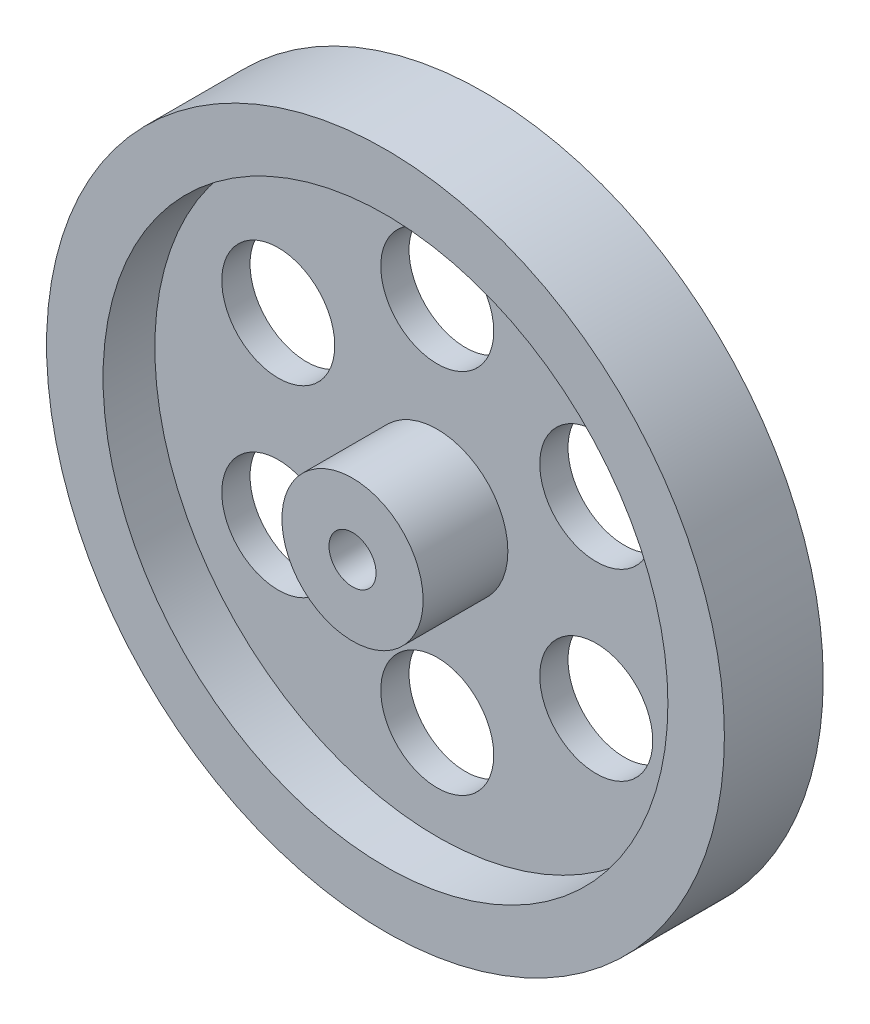
ISO-10303-21;
HEADER;
FILE_DESCRIPTION(('STEP AP214'),'2;1');
FILE_NAME('part.step','',(''),(''),'','','');
FILE_SCHEMA(('AUTOMOTIVE_DESIGN { 1 0 10303 214 1 1 1 1 }'));
ENDSEC;
DATA;
#1=APPLICATION_CONTEXT('core data for automotive mechanical design processes');
#2=APPLICATION_PROTOCOL_DEFINITION('international standard','automotive_design',2000,#1);
#3=PRODUCT_CONTEXT('',#1,'mechanical');
#4=PRODUCT('Part','Part','',(#3));
#5=PRODUCT_RELATED_PRODUCT_CATEGORY('part','',(#4));
#6=PRODUCT_DEFINITION_FORMATION('','',#4);
#7=PRODUCT_DEFINITION_CONTEXT('part definition',#1,'design');
#8=PRODUCT_DEFINITION('design','',#6,#7);
#9=PRODUCT_DEFINITION_SHAPE('','',#8);
#10=(LENGTH_UNIT() NAMED_UNIT(*) SI_UNIT(.MILLI.,.METRE.));
#11=(NAMED_UNIT(*) PLANE_ANGLE_UNIT() SI_UNIT($,.RADIAN.));
#12=(NAMED_UNIT(*) SI_UNIT($,.STERADIAN.) SOLID_ANGLE_UNIT());
#13=UNCERTAINTY_MEASURE_WITH_UNIT(LENGTH_MEASURE(1.E-05),#10,'distance_accuracy_value','');
#14=(GEOMETRIC_REPRESENTATION_CONTEXT(3) GLOBAL_UNCERTAINTY_ASSIGNED_CONTEXT((#13)) GLOBAL_UNIT_ASSIGNED_CONTEXT((#10,
#11,#12)) REPRESENTATION_CONTEXT('',''));
#15=CARTESIAN_POINT('',(0.,0.,0.));
#16=DIRECTION('',(0.,0.,1.));
#17=DIRECTION('',(1.,0.,0.));
#18=AXIS2_PLACEMENT_3D('',#15,#16,#17);
#19=CARTESIAN_POINT('',(0.,0.,12.));
#20=DIRECTION('',(0.,0.,-1.));
#21=DIRECTION('',(-1.,0.,0.));
#22=AXIS2_PLACEMENT_3D('',#19,#20,#21);
#23=CYLINDRICAL_SURFACE('',#22,7.5);
#24=CARTESIAN_POINT('',(0.,0.,3.));
#25=DIRECTION('',(0.,0.,1.));
#26=DIRECTION('',(1.,0.,0.));
#27=AXIS2_PLACEMENT_3D('',#24,#25,#26);
#28=CIRCLE('',#27,7.5);
#29=CARTESIAN_POINT('',(7.5,0.,3.));
#30=VERTEX_POINT('',#29);
#31=EDGE_CURVE('E75',#30,#30,#28,.T.);
#32=ORIENTED_EDGE('',*,*,#31,.T.);
#33=EDGE_LOOP('',(#32));
#34=FACE_BOUND('',#33,.T.);
#35=CARTESIAN_POINT('',(0.,0.,12.));
#36=DIRECTION('',(0.,0.,1.));
#37=DIRECTION('',(1.,0.,0.));
#38=AXIS2_PLACEMENT_3D('',#35,#36,#37);
#39=CIRCLE('',#38,7.5);
#40=CARTESIAN_POINT('',(7.5,0.,12.));
#41=VERTEX_POINT('',#40);
#42=EDGE_CURVE('E46',#41,#41,#39,.T.);
#43=ORIENTED_EDGE('',*,*,#42,.F.);
#44=EDGE_LOOP('',(#43));
#45=FACE_BOUND('',#44,.T.);
#46=ADVANCED_FACE('F39',(#34,#45),#23,.T.);
#47=CARTESIAN_POINT('',(0.,0.,12.));
#48=DIRECTION('',(0.,0.,-1.));
#49=DIRECTION('',(-1.,0.,0.));
#50=AXIS2_PLACEMENT_3D('',#47,#48,#49);
#51=CYLINDRICAL_SURFACE('',#50,2.5);
#52=CARTESIAN_POINT('',(0.,0.,12.));
#53=DIRECTION('',(0.,0.,1.));
#54=DIRECTION('',(1.,0.,0.));
#55=AXIS2_PLACEMENT_3D('',#52,#53,#54);
#56=CIRCLE('',#55,2.5);
#57=CARTESIAN_POINT('',(2.5,0.,12.));
#58=VERTEX_POINT('',#57);
#59=EDGE_CURVE('E10',#58,#58,#56,.T.);
#60=ORIENTED_EDGE('',*,*,#59,.T.);
#61=EDGE_LOOP('',(#60));
#62=FACE_BOUND('',#61,.T.);
#63=CARTESIAN_POINT('',(0.,0.,0.));
#64=DIRECTION('',(0.,0.,1.));
#65=DIRECTION('',(1.,0.,0.));
#66=AXIS2_PLACEMENT_3D('',#63,#64,#65);
#67=CIRCLE('',#66,2.5);
#68=CARTESIAN_POINT('',(2.5,0.,0.));
#69=VERTEX_POINT('',#68);
#70=EDGE_CURVE('E42',#69,#69,#67,.T.);
#71=ORIENTED_EDGE('',*,*,#70,.F.);
#72=EDGE_LOOP('',(#71));
#73=FACE_BOUND('',#72,.T.);
#74=ADVANCED_FACE('F130',(#62,#73),#51,.F.);
#75=CARTESIAN_POINT('',(0.,0.,12.));
#76=DIRECTION('',(0.,0.,1.));
#77=DIRECTION('',(1.,0.,0.));
#78=AXIS2_PLACEMENT_3D('',#75,#76,#77);
#79=PLANE('',#78);
#80=ORIENTED_EDGE('',*,*,#42,.T.);
#81=EDGE_LOOP('',(#80));
#82=FACE_BOUND('',#81,.T.);
#83=ORIENTED_EDGE('',*,*,#59,.F.);
#84=EDGE_LOOP('',(#83));
#85=FACE_BOUND('',#84,.T.);
#86=ADVANCED_FACE('F135',(#82,#85),#79,.T.);
#87=CARTESIAN_POINT('',(0.,0.,0.));
#88=DIRECTION('',(0.,0.,1.));
#89=DIRECTION('',(1.,0.,0.));
#90=AXIS2_PLACEMENT_3D('',#87,#88,#89);
#91=PLANE('',#90);
#92=ORIENTED_EDGE('',*,*,#70,.T.);
#93=EDGE_LOOP('',(#92));
#94=FACE_BOUND('',#93,.T.);
#95=CARTESIAN_POINT('',(0.,19.5,0.));
#96=DIRECTION('',(0.,0.,1.));
#97=DIRECTION('',(1.,0.,0.));
#98=AXIS2_PLACEMENT_3D('',#95,#96,#97);
#99=CIRCLE('',#98,6.);
#100=CARTESIAN_POINT('',(6.,19.5,0.));
#101=VERTEX_POINT('',#100);
#102=EDGE_CURVE('E71',#101,#101,#99,.T.);
#103=ORIENTED_EDGE('',*,*,#102,.T.);
#104=EDGE_LOOP('',(#103));
#105=FACE_BOUND('',#104,.T.);
#106=CARTESIAN_POINT('',(0.,0.,0.));
#107=DIRECTION('',(0.,0.,1.));
#108=DIRECTION('',(1.,0.,0.));
#109=AXIS2_PLACEMENT_3D('',#106,#107,#108);
#110=CIRCLE('',#109,30.);
#111=CARTESIAN_POINT('',(30.,0.,0.));
#112=VERTEX_POINT('',#111);
#113=EDGE_CURVE('E68',#112,#112,#110,.T.);
#114=ORIENTED_EDGE('',*,*,#113,.F.);
#115=EDGE_LOOP('',(#114));
#116=FACE_BOUND('',#115,.T.);
#117=CARTESIAN_POINT('',(-16.8874953737966,9.74999999999999,0.));
#118=DIRECTION('',(0.,0.,1.));
#119=DIRECTION('',(1.,0.,0.));
#120=AXIS2_PLACEMENT_3D('',#117,#118,#119);
#121=CIRCLE('',#120,6.);
#122=CARTESIAN_POINT('',(-10.8874953737966,9.74999999999999,0.));
#123=VERTEX_POINT('',#122);
#124=EDGE_CURVE('E65',#123,#123,#121,.T.);
#125=ORIENTED_EDGE('',*,*,#124,.T.);
#126=EDGE_LOOP('',(#125));
#127=FACE_BOUND('',#126,.T.);
#128=CARTESIAN_POINT('',(-16.8874953737966,-9.75000000000001,0.));
#129=DIRECTION('',(0.,0.,1.));
#130=DIRECTION('',(1.,0.,0.));
#131=AXIS2_PLACEMENT_3D('',#128,#129,#130);
#132=CIRCLE('',#131,6.);
#133=CARTESIAN_POINT('',(-10.8874953737966,-9.75000000000001,0.));
#134=VERTEX_POINT('',#133);
#135=EDGE_CURVE('E62',#134,#134,#132,.T.);
#136=ORIENTED_EDGE('',*,*,#135,.T.);
#137=EDGE_LOOP('',(#136));
#138=FACE_BOUND('',#137,.T.);
#139=CARTESIAN_POINT('',(0.,-19.5,0.));
#140=DIRECTION('',(0.,0.,1.));
#141=DIRECTION('',(1.,0.,0.));
#142=AXIS2_PLACEMENT_3D('',#139,#140,#141);
#143=CIRCLE('',#142,6.);
#144=CARTESIAN_POINT('',(6.,-19.5,0.));
#145=VERTEX_POINT('',#144);
#146=EDGE_CURVE('E59',#145,#145,#143,.T.);
#147=ORIENTED_EDGE('',*,*,#146,.T.);
#148=EDGE_LOOP('',(#147));
#149=FACE_BOUND('',#148,.T.);
#150=CARTESIAN_POINT('',(16.8874953737966,-9.75,0.));
#151=DIRECTION('',(0.,0.,1.));
#152=DIRECTION('',(1.,0.,0.));
#153=AXIS2_PLACEMENT_3D('',#150,#151,#152);
#154=CIRCLE('',#153,6.);
#155=CARTESIAN_POINT('',(22.8874953737966,-9.75,0.));
#156=VERTEX_POINT('',#155);
#157=EDGE_CURVE('E56',#156,#156,#154,.T.);
#158=ORIENTED_EDGE('',*,*,#157,.T.);
#159=EDGE_LOOP('',(#158));
#160=FACE_BOUND('',#159,.T.);
#161=CARTESIAN_POINT('',(16.8874953737966,9.75000000000001,0.));
#162=DIRECTION('',(0.,0.,1.));
#163=DIRECTION('',(1.,0.,0.));
#164=AXIS2_PLACEMENT_3D('',#161,#162,#163);
#165=CIRCLE('',#164,6.);
#166=CARTESIAN_POINT('',(22.8874953737966,9.75000000000001,0.));
#167=VERTEX_POINT('',#166);
#168=EDGE_CURVE('E52',#167,#167,#165,.T.);
#169=ORIENTED_EDGE('',*,*,#168,.T.);
#170=EDGE_LOOP('',(#169));
#171=FACE_BOUND('',#170,.T.);
#172=ADVANCED_FACE('F142',(#94,#105,#116,#127,#138,#149,#160,#171),#91,.F.);
#173=CARTESIAN_POINT('',(16.8874953737966,9.75000000000001,3.));
#174=DIRECTION('',(0.,0.,-1.));
#175=DIRECTION('',(-1.,0.,0.));
#176=AXIS2_PLACEMENT_3D('',#173,#174,#175);
#177=CYLINDRICAL_SURFACE('',#176,6.);
#178=CARTESIAN_POINT('',(16.8874953737966,9.75000000000001,3.));
#179=DIRECTION('',(0.,0.,1.));
#180=DIRECTION('',(1.,0.,0.));
#181=AXIS2_PLACEMENT_3D('',#178,#179,#180);
#182=CIRCLE('',#181,6.);
#183=CARTESIAN_POINT('',(22.8874953737966,9.75000000000001,3.));
#184=VERTEX_POINT('',#183);
#185=EDGE_CURVE('E78',#184,#184,#182,.T.);
#186=ORIENTED_EDGE('',*,*,#185,.T.);
#187=EDGE_LOOP('',(#186));
#188=FACE_BOUND('',#187,.T.);
#189=ORIENTED_EDGE('',*,*,#168,.F.);
#190=EDGE_LOOP('',(#189));
#191=FACE_BOUND('',#190,.T.);
#192=ADVANCED_FACE('F147',(#188,#191),#177,.F.);
#193=CARTESIAN_POINT('',(16.8874953737966,-9.75,3.));
#194=DIRECTION('',(0.,0.,-1.));
#195=DIRECTION('',(-1.,0.,0.));
#196=AXIS2_PLACEMENT_3D('',#193,#194,#195);
#197=CYLINDRICAL_SURFACE('',#196,6.);
#198=CARTESIAN_POINT('',(16.8874953737966,-9.75,3.));
#199=DIRECTION('',(0.,0.,1.));
#200=DIRECTION('',(1.,0.,0.));
#201=AXIS2_PLACEMENT_3D('',#198,#199,#200);
#202=CIRCLE('',#201,6.);
#203=CARTESIAN_POINT('',(22.8874953737966,-9.75,3.));
#204=VERTEX_POINT('',#203);
#205=EDGE_CURVE('E81',#204,#204,#202,.T.);
#206=ORIENTED_EDGE('',*,*,#205,.T.);
#207=EDGE_LOOP('',(#206));
#208=FACE_BOUND('',#207,.T.);
#209=ORIENTED_EDGE('',*,*,#157,.F.);
#210=EDGE_LOOP('',(#209));
#211=FACE_BOUND('',#210,.T.);
#212=ADVANCED_FACE('F166',(#208,#211),#197,.F.);
#213=CARTESIAN_POINT('',(0.,-19.5,3.));
#214=DIRECTION('',(0.,0.,-1.));
#215=DIRECTION('',(-1.,0.,0.));
#216=AXIS2_PLACEMENT_3D('',#213,#214,#215);
#217=CYLINDRICAL_SURFACE('',#216,6.);
#218=CARTESIAN_POINT('',(0.,-19.5,3.));
#219=DIRECTION('',(0.,0.,1.));
#220=DIRECTION('',(1.,0.,0.));
#221=AXIS2_PLACEMENT_3D('',#218,#219,#220);
#222=CIRCLE('',#221,6.);
#223=CARTESIAN_POINT('',(6.,-19.5,3.));
#224=VERTEX_POINT('',#223);
#225=EDGE_CURVE('E84',#224,#224,#222,.T.);
#226=ORIENTED_EDGE('',*,*,#225,.T.);
#227=EDGE_LOOP('',(#226));
#228=FACE_BOUND('',#227,.T.);
#229=ORIENTED_EDGE('',*,*,#146,.F.);
#230=EDGE_LOOP('',(#229));
#231=FACE_BOUND('',#230,.T.);
#232=ADVANCED_FACE('F162',(#228,#231),#217,.F.);
#233=CARTESIAN_POINT('',(-16.8874953737966,-9.75000000000001,3.));
#234=DIRECTION('',(0.,0.,-1.));
#235=DIRECTION('',(-1.,0.,0.));
#236=AXIS2_PLACEMENT_3D('',#233,#234,#235);
#237=CYLINDRICAL_SURFACE('',#236,6.);
#238=CARTESIAN_POINT('',(-16.8874953737966,-9.75000000000001,3.));
#239=DIRECTION('',(0.,0.,1.));
#240=DIRECTION('',(1.,0.,0.));
#241=AXIS2_PLACEMENT_3D('',#238,#239,#240);
#242=CIRCLE('',#241,6.);
#243=CARTESIAN_POINT('',(-10.8874953737966,-9.75000000000001,3.));
#244=VERTEX_POINT('',#243);
#245=EDGE_CURVE('E87',#244,#244,#242,.T.);
#246=ORIENTED_EDGE('',*,*,#245,.T.);
#247=EDGE_LOOP('',(#246));
#248=FACE_BOUND('',#247,.T.);
#249=ORIENTED_EDGE('',*,*,#135,.F.);
#250=EDGE_LOOP('',(#249));
#251=FACE_BOUND('',#250,.T.);
#252=ADVANCED_FACE('F158',(#248,#251),#237,.F.);
#253=CARTESIAN_POINT('',(-16.8874953737966,9.74999999999999,3.));
#254=DIRECTION('',(0.,0.,-1.));
#255=DIRECTION('',(-1.,0.,0.));
#256=AXIS2_PLACEMENT_3D('',#253,#254,#255);
#257=CYLINDRICAL_SURFACE('',#256,6.);
#258=CARTESIAN_POINT('',(-16.8874953737966,9.74999999999999,3.));
#259=DIRECTION('',(0.,0.,1.));
#260=DIRECTION('',(1.,0.,0.));
#261=AXIS2_PLACEMENT_3D('',#258,#259,#260);
#262=CIRCLE('',#261,6.);
#263=CARTESIAN_POINT('',(-10.8874953737966,9.74999999999999,3.));
#264=VERTEX_POINT('',#263);
#265=EDGE_CURVE('E90',#264,#264,#262,.T.);
#266=ORIENTED_EDGE('',*,*,#265,.T.);
#267=EDGE_LOOP('',(#266));
#268=FACE_BOUND('',#267,.T.);
#269=ORIENTED_EDGE('',*,*,#124,.F.);
#270=EDGE_LOOP('',(#269));
#271=FACE_BOUND('',#270,.T.);
#272=ADVANCED_FACE('F154',(#268,#271),#257,.F.);
#273=CARTESIAN_POINT('',(0.,19.5,3.));
#274=DIRECTION('',(0.,0.,-1.));
#275=DIRECTION('',(-1.,0.,0.));
#276=AXIS2_PLACEMENT_3D('',#273,#274,#275);
#277=CYLINDRICAL_SURFACE('',#276,6.);
#278=CARTESIAN_POINT('',(0.,19.5,3.));
#279=DIRECTION('',(0.,0.,1.));
#280=DIRECTION('',(1.,0.,0.));
#281=AXIS2_PLACEMENT_3D('',#278,#279,#280);
#282=CIRCLE('',#281,6.);
#283=CARTESIAN_POINT('',(6.,19.5,3.));
#284=VERTEX_POINT('',#283);
#285=EDGE_CURVE('E55',#284,#284,#282,.T.);
#286=ORIENTED_EDGE('',*,*,#285,.T.);
#287=EDGE_LOOP('',(#286));
#288=FACE_BOUND('',#287,.T.);
#289=ORIENTED_EDGE('',*,*,#102,.F.);
#290=EDGE_LOOP('',(#289));
#291=FACE_BOUND('',#290,.T.);
#292=ADVANCED_FACE('F151',(#288,#291),#277,.F.);
#293=CARTESIAN_POINT('',(0.,0.,3.));
#294=DIRECTION('',(0.,0.,1.));
#295=DIRECTION('',(1.,0.,0.));
#296=AXIS2_PLACEMENT_3D('',#293,#294,#295);
#297=PLANE('',#296);
#298=ORIENTED_EDGE('',*,*,#285,.F.);
#299=EDGE_LOOP('',(#298));
#300=FACE_BOUND('',#299,.T.);
#301=CARTESIAN_POINT('',(0.,0.,3.));
#302=DIRECTION('',(0.,0.,1.));
#303=DIRECTION('',(1.,0.,0.));
#304=AXIS2_PLACEMENT_3D('',#301,#302,#303);
#305=CIRCLE('',#304,30.);
#306=CARTESIAN_POINT('',(30.,0.,3.));
#307=VERTEX_POINT('',#306);
#308=EDGE_CURVE('E74',#307,#307,#305,.T.);
#309=ORIENTED_EDGE('',*,*,#308,.T.);
#310=EDGE_LOOP('',(#309));
#311=FACE_BOUND('',#310,.T.);
#312=ORIENTED_EDGE('',*,*,#265,.F.);
#313=EDGE_LOOP('',(#312));
#314=FACE_BOUND('',#313,.T.);
#315=ORIENTED_EDGE('',*,*,#245,.F.);
#316=EDGE_LOOP('',(#315));
#317=FACE_BOUND('',#316,.T.);
#318=ORIENTED_EDGE('',*,*,#225,.F.);
#319=EDGE_LOOP('',(#318));
#320=FACE_BOUND('',#319,.T.);
#321=ORIENTED_EDGE('',*,*,#205,.F.);
#322=EDGE_LOOP('',(#321));
#323=FACE_BOUND('',#322,.T.);
#324=ORIENTED_EDGE('',*,*,#185,.F.);
#325=EDGE_LOOP('',(#324));
#326=FACE_BOUND('',#325,.T.);
#327=ORIENTED_EDGE('',*,*,#31,.F.);
#328=EDGE_LOOP('',(#327));
#329=FACE_BOUND('',#328,.T.);
#330=ADVANCED_FACE('F126',(#300,#311,#314,#317,#320,#323,#326,#329),#297,.T.);
#331=CARTESIAN_POINT('',(0.,0.,-2.));
#332=DIRECTION('',(0.,0.,1.));
#333=DIRECTION('',(1.,0.,0.));
#334=AXIS2_PLACEMENT_3D('',#331,#332,#333);
#335=CYLINDRICAL_SURFACE('',#334,30.);
#336=CARTESIAN_POINT('',(0.,0.,-2.));
#337=DIRECTION('',(0.,0.,1.));
#338=DIRECTION('',(1.,0.,0.));
#339=AXIS2_PLACEMENT_3D('',#336,#337,#338);
#340=CIRCLE('',#339,30.);
#341=CARTESIAN_POINT('',(30.,0.,-2.));
#342=VERTEX_POINT('',#341);
#343=EDGE_CURVE('E97',#342,#342,#340,.T.);
#344=ORIENTED_EDGE('',*,*,#343,.F.);
#345=EDGE_LOOP('',(#344));
#346=FACE_BOUND('',#345,.T.);
#347=ORIENTED_EDGE('',*,*,#113,.T.);
#348=EDGE_LOOP('',(#347));
#349=FACE_BOUND('',#348,.T.);
#350=ADVANCED_FACE('F116',(#346,#349),#335,.F.);
#351=CARTESIAN_POINT('',(0.,0.,-2.));
#352=DIRECTION('',(0.,0.,1.));
#353=DIRECTION('',(1.,0.,0.));
#354=AXIS2_PLACEMENT_3D('',#351,#352,#353);
#355=CYLINDRICAL_SURFACE('',#354,36.);
#356=CARTESIAN_POINT('',(0.,0.,-2.));
#357=DIRECTION('',(0.,0.,1.));
#358=DIRECTION('',(1.,0.,0.));
#359=AXIS2_PLACEMENT_3D('',#356,#357,#358);
#360=CIRCLE('',#359,36.);
#361=CARTESIAN_POINT('',(36.,0.,-2.));
#362=VERTEX_POINT('',#361);
#363=EDGE_CURVE('E100',#362,#362,#360,.T.);
#364=ORIENTED_EDGE('',*,*,#363,.T.);
#365=EDGE_LOOP('',(#364));
#366=FACE_BOUND('',#365,.T.);
#367=CARTESIAN_POINT('',(0.,0.,8.5));
#368=DIRECTION('',(0.,0.,1.));
#369=DIRECTION('',(1.,0.,0.));
#370=AXIS2_PLACEMENT_3D('',#367,#368,#369);
#371=CIRCLE('',#370,36.);
#372=CARTESIAN_POINT('',(36.,0.,8.5));
#373=VERTEX_POINT('',#372);
#374=EDGE_CURVE('E106',#373,#373,#371,.T.);
#375=ORIENTED_EDGE('',*,*,#374,.F.);
#376=EDGE_LOOP('',(#375));
#377=FACE_BOUND('',#376,.T.);
#378=ADVANCED_FACE('F113',(#366,#377),#355,.T.);
#379=ORIENTED_EDGE('',*,*,#308,.F.);
#380=EDGE_LOOP('',(#379));
#381=FACE_BOUND('',#380,.T.);
#382=CARTESIAN_POINT('',(0.,0.,8.5));
#383=DIRECTION('',(0.,0.,1.));
#384=DIRECTION('',(1.,0.,0.));
#385=AXIS2_PLACEMENT_3D('',#382,#383,#384);
#386=CIRCLE('',#385,30.);
#387=CARTESIAN_POINT('',(30.,0.,8.5));
#388=VERTEX_POINT('',#387);
#389=EDGE_CURVE('E103',#388,#388,#386,.T.);
#390=ORIENTED_EDGE('',*,*,#389,.T.);
#391=EDGE_LOOP('',(#390));
#392=FACE_BOUND('',#391,.T.);
#393=ADVANCED_FACE('F115',(#381,#392),#335,.F.);
#394=CARTESIAN_POINT('',(0.,0.,-2.));
#395=DIRECTION('',(0.,0.,1.));
#396=DIRECTION('',(1.,0.,0.));
#397=AXIS2_PLACEMENT_3D('',#394,#395,#396);
#398=PLANE('',#397);
#399=ORIENTED_EDGE('',*,*,#363,.F.);
#400=EDGE_LOOP('',(#399));
#401=FACE_BOUND('',#400,.T.);
#402=ORIENTED_EDGE('',*,*,#343,.T.);
#403=EDGE_LOOP('',(#402));
#404=FACE_BOUND('',#403,.T.);
#405=ADVANCED_FACE('F123',(#401,#404),#398,.F.);
#406=CARTESIAN_POINT('',(0.,0.,8.5));
#407=DIRECTION('',(0.,0.,1.));
#408=DIRECTION('',(1.,0.,0.));
#409=AXIS2_PLACEMENT_3D('',#406,#407,#408);
#410=PLANE('',#409);
#411=ORIENTED_EDGE('',*,*,#374,.T.);
#412=EDGE_LOOP('',(#411));
#413=FACE_BOUND('',#412,.T.);
#414=ORIENTED_EDGE('',*,*,#389,.F.);
#415=EDGE_LOOP('',(#414));
#416=FACE_BOUND('',#415,.T.);
#417=ADVANCED_FACE('F110',(#413,#416),#410,.T.);
#418=CLOSED_SHELL('',(#46,#74,#86,#172,#192,#212,#232,#252,#272,#292,#330,#350,#378,#393,#405,#417));
#419=MANIFOLD_SOLID_BREP('B2',#418);
#420=ADVANCED_BREP_SHAPE_REPRESENTATION('',(#18,#419),#14);
#421=SHAPE_DEFINITION_REPRESENTATION(#9,#420);
ENDSEC;
END-ISO-10303-21;
